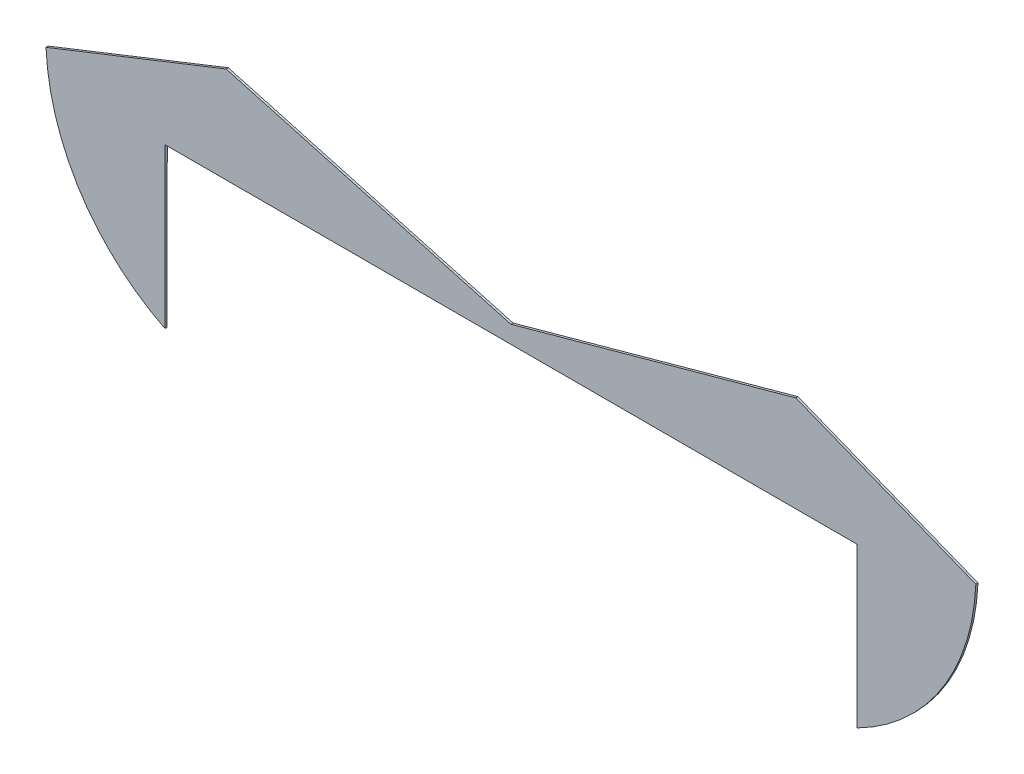
ISO-10303-21;
HEADER;
FILE_DESCRIPTION(('STEP AP214'),'2;1');
FILE_NAME('part.step','',(''),(''),'','','');
FILE_SCHEMA(('AUTOMOTIVE_DESIGN { 1 0 10303 214 1 1 1 1 }'));
ENDSEC;
DATA;
#1=APPLICATION_CONTEXT('core data for automotive mechanical design processes');
#2=APPLICATION_PROTOCOL_DEFINITION('international standard','automotive_design',2000,#1);
#3=PRODUCT_CONTEXT('',#1,'mechanical');
#4=PRODUCT('Part','Part','',(#3));
#5=PRODUCT_RELATED_PRODUCT_CATEGORY('part','',(#4));
#6=PRODUCT_DEFINITION_FORMATION('','',#4);
#7=PRODUCT_DEFINITION_CONTEXT('part definition',#1,'design');
#8=PRODUCT_DEFINITION('design','',#6,#7);
#9=PRODUCT_DEFINITION_SHAPE('','',#8);
#10=(LENGTH_UNIT() NAMED_UNIT(*) SI_UNIT(.MILLI.,.METRE.));
#11=(NAMED_UNIT(*) PLANE_ANGLE_UNIT() SI_UNIT($,.RADIAN.));
#12=(NAMED_UNIT(*) SI_UNIT($,.STERADIAN.) SOLID_ANGLE_UNIT());
#13=UNCERTAINTY_MEASURE_WITH_UNIT(LENGTH_MEASURE(1.E-05),#10,'distance_accuracy_value','');
#14=(GEOMETRIC_REPRESENTATION_CONTEXT(3) GLOBAL_UNCERTAINTY_ASSIGNED_CONTEXT((#13)) GLOBAL_UNIT_ASSIGNED_CONTEXT((#10,
#11,#12)) REPRESENTATION_CONTEXT('',''));
#15=CARTESIAN_POINT('',(0.,0.,0.));
#16=DIRECTION('',(0.,0.,1.));
#17=DIRECTION('',(1.,0.,0.));
#18=AXIS2_PLACEMENT_3D('',#15,#16,#17);
#19=CARTESIAN_POINT('',(23.1397358936744,18.5168922845504,0.1));
#20=DIRECTION('',(0.,0.,-1.));
#21=DIRECTION('',(-1.,0.,0.));
#22=AXIS2_PLACEMENT_3D('',#19,#20,#21);
#23=CYLINDRICAL_SURFACE('',#22,10.1092077518607);
#24=CARTESIAN_POINT('',(23.1397358936744,18.5168922845504,0.));
#25=DIRECTION('',(0.,0.,1.));
#26=DIRECTION('',(1.,0.,0.));
#27=AXIS2_PLACEMENT_3D('',#24,#25,#26);
#28=CIRCLE('',#27,10.1092077518607);
#29=CARTESIAN_POINT('',(13.0400932848332,18.0772327071957,0.));
#30=VERTEX_POINT('',#29);
#31=CARTESIAN_POINT('',(14.4941914447268,13.2775562052793,0.));
#32=VERTEX_POINT('',#31);
#33=EDGE_CURVE('E141',#30,#32,#28,.T.);
#34=ORIENTED_EDGE('',*,*,#33,.T.);
#35=DIRECTION('',(0.,0.,-1.));
#36=VECTOR('',#35,1.);
#37=CARTESIAN_POINT('',(14.4941914447268,13.2775562052793,0.1));
#38=LINE('',#37,#36);
#39=CARTESIAN_POINT('',(14.4941914447268,13.2775562052793,0.1));
#40=VERTEX_POINT('',#39);
#41=EDGE_CURVE('E11',#40,#32,#38,.T.);
#42=ORIENTED_EDGE('',*,*,#41,.F.);
#43=CARTESIAN_POINT('',(23.1397358936744,18.5168922845504,0.1));
#44=DIRECTION('',(0.,0.,1.));
#45=DIRECTION('',(1.,0.,0.));
#46=AXIS2_PLACEMENT_3D('',#43,#44,#45);
#47=CIRCLE('',#46,10.1092077518607);
#48=CARTESIAN_POINT('',(13.0400932848332,18.0772327071957,0.1));
#49=VERTEX_POINT('',#48);
#50=EDGE_CURVE('E161',#49,#40,#47,.T.);
#51=ORIENTED_EDGE('',*,*,#50,.F.);
#52=DIRECTION('',(0.,0.,-1.));
#53=VECTOR('',#52,1.);
#54=CARTESIAN_POINT('',(13.0400932848332,18.0772327071957,0.1));
#55=LINE('',#54,#53);
#56=EDGE_CURVE('E137',#49,#30,#55,.T.);
#57=ORIENTED_EDGE('',*,*,#56,.T.);
#58=EDGE_LOOP('',(#34,#42,#51,#57));
#59=FACE_BOUND('',#58,.T.);
#60=ADVANCED_FACE('F33',(#59),#23,.T.);
#61=CARTESIAN_POINT('',(22.9791031053819,18.4661762448987,0.1));
#62=DIRECTION('',(0.,0.,-1.));
#63=DIRECTION('',(-1.,0.,0.));
#64=AXIS2_PLACEMENT_3D('',#61,#62,#63);
#65=CYLINDRICAL_SURFACE('',#64,9.94562737109439);
#66=CARTESIAN_POINT('',(22.9791031053819,18.4661762448987,0.));
#67=DIRECTION('',(0.,0.,1.));
#68=DIRECTION('',(1.,0.,0.));
#69=AXIS2_PLACEMENT_3D('',#66,#67,#68);
#70=CIRCLE('',#69,9.94562737109439);
#71=CARTESIAN_POINT('',(18.5466400125416,9.56287490577339,0.));
#72=VERTEX_POINT('',#71);
#73=EDGE_CURVE('E144',#32,#72,#70,.T.);
#74=ORIENTED_EDGE('',*,*,#73,.T.);
#75=DIRECTION('',(0.,0.,-1.));
#76=VECTOR('',#75,1.);
#77=CARTESIAN_POINT('',(18.5466400125416,9.56287490577339,0.1));
#78=LINE('',#77,#76);
#79=CARTESIAN_POINT('',(18.5466400125416,9.56287490577339,0.1));
#80=VERTEX_POINT('',#79);
#81=EDGE_CURVE('E41',#80,#72,#78,.T.);
#82=ORIENTED_EDGE('',*,*,#81,.F.);
#83=CARTESIAN_POINT('',(22.9791031053819,18.4661762448987,0.1));
#84=DIRECTION('',(0.,0.,1.));
#85=DIRECTION('',(1.,0.,0.));
#86=AXIS2_PLACEMENT_3D('',#83,#84,#85);
#87=CIRCLE('',#86,9.94562737109439);
#88=EDGE_CURVE('E98',#40,#80,#87,.T.);
#89=ORIENTED_EDGE('',*,*,#88,.F.);
#90=ORIENTED_EDGE('',*,*,#41,.T.);
#91=EDGE_LOOP('',(#74,#82,#89,#90));
#92=FACE_BOUND('',#91,.T.);
#93=ADVANCED_FACE('F208',(#92),#65,.T.);
#94=CARTESIAN_POINT('',(18.5466400125416,9.56287490577339,0.1));
#95=DIRECTION('',(-0.999999928074789,0.000379276175397335,0.));
#96=DIRECTION('',(-0.000379276175397335,-0.999999928074789,0.));
#97=AXIS2_PLACEMENT_3D('',#94,#95,#96);
#98=PLANE('',#97);
#99=DIRECTION('',(0.000379276175397335,0.999999928074789,0.));
#100=VECTOR('',#99,1.);
#101=CARTESIAN_POINT('',(18.5466400125416,9.56287490577339,0.));
#102=LINE('',#101,#100);
#103=CARTESIAN_POINT('',(18.5494338989535,16.9292385007342,0.));
#104=VERTEX_POINT('',#103);
#105=EDGE_CURVE('E146',#72,#104,#102,.T.);
#106=ORIENTED_EDGE('',*,*,#105,.T.);
#107=DIRECTION('',(0.,0.,-1.));
#108=VECTOR('',#107,1.);
#109=CARTESIAN_POINT('',(18.5494338989535,16.9292385007342,0.1));
#110=LINE('',#109,#108);
#111=CARTESIAN_POINT('',(18.5494338989535,16.9292385007342,0.1));
#112=VERTEX_POINT('',#111);
#113=EDGE_CURVE('E174',#112,#104,#110,.T.);
#114=ORIENTED_EDGE('',*,*,#113,.F.);
#115=DIRECTION('',(0.000379276175397335,0.999999928074789,0.));
#116=VECTOR('',#115,1.);
#117=CARTESIAN_POINT('',(18.5466400125416,9.56287490577339,0.1));
#118=LINE('',#117,#116);
#119=EDGE_CURVE('E182',#80,#112,#118,.T.);
#120=ORIENTED_EDGE('',*,*,#119,.F.);
#121=ORIENTED_EDGE('',*,*,#81,.T.);
#122=EDGE_LOOP('',(#106,#114,#120,#121));
#123=FACE_BOUND('',#122,.T.);
#124=ADVANCED_FACE('F180',(#123),#98,.F.);
#125=CARTESIAN_POINT('',(35.0494338989535,16.9292385007342,0.1));
#126=DIRECTION('',(0.,1.,0.));
#127=DIRECTION('',(0.,0.,1.));
#128=AXIS2_PLACEMENT_3D('',#125,#126,#127);
#129=PLANE('',#128);
#130=DIRECTION('',(1.,0.,0.));
#131=VECTOR('',#130,1.);
#132=CARTESIAN_POINT('',(35.0494338989535,16.9292385007342,0.));
#133=LINE('',#132,#131);
#134=CARTESIAN_POINT('',(50.5494338989535,16.9292385007342,0.));
#135=VERTEX_POINT('',#134);
#136=EDGE_CURVE('E149',#104,#135,#133,.T.);
#137=ORIENTED_EDGE('',*,*,#136,.T.);
#138=DIRECTION('',(0.,0.,-1.));
#139=VECTOR('',#138,1.);
#140=CARTESIAN_POINT('',(50.5494338989535,16.9292385007342,0.1));
#141=LINE('',#140,#139);
#142=CARTESIAN_POINT('',(50.5494338989535,16.9292385007342,0.1));
#143=VERTEX_POINT('',#142);
#144=EDGE_CURVE('E171',#143,#135,#141,.T.);
#145=ORIENTED_EDGE('',*,*,#144,.F.);
#146=DIRECTION('',(1.,0.,0.));
#147=VECTOR('',#146,1.);
#148=CARTESIAN_POINT('',(18.5494338989535,16.9292385007342,0.1));
#149=LINE('',#148,#147);
#150=EDGE_CURVE('E198',#112,#143,#149,.T.);
#151=ORIENTED_EDGE('',*,*,#150,.F.);
#152=ORIENTED_EDGE('',*,*,#113,.T.);
#153=EDGE_LOOP('',(#137,#145,#151,#152));
#154=FACE_BOUND('',#153,.T.);
#155=ADVANCED_FACE('F189',(#154),#129,.F.);
#156=CARTESIAN_POINT('',(50.5494338989535,16.9292385007342,0.1));
#157=DIRECTION('',(1.,0.,0.));
#158=DIRECTION('',(0.,0.,-1.));
#159=AXIS2_PLACEMENT_3D('',#156,#157,#158);
#160=PLANE('',#159);
#161=DIRECTION('',(0.,-1.,0.));
#162=VECTOR('',#161,1.);
#163=CARTESIAN_POINT('',(50.5494338989535,16.9292385007342,0.));
#164=LINE('',#163,#162);
#165=CARTESIAN_POINT('',(50.5494338989535,9.5643948782772,0.));
#166=VERTEX_POINT('',#165);
#167=EDGE_CURVE('E151',#135,#166,#164,.T.);
#168=ORIENTED_EDGE('',*,*,#167,.T.);
#169=DIRECTION('',(0.,0.,-1.));
#170=VECTOR('',#169,1.);
#171=CARTESIAN_POINT('',(50.5494338989535,9.5643948782772,0.1));
#172=LINE('',#171,#170);
#173=CARTESIAN_POINT('',(50.5494338989535,9.5643948782772,0.1));
#174=VERTEX_POINT('',#173);
#175=EDGE_CURVE('E168',#174,#166,#172,.T.);
#176=ORIENTED_EDGE('',*,*,#175,.F.);
#177=DIRECTION('',(0.,-1.,0.));
#178=VECTOR('',#177,1.);
#179=CARTESIAN_POINT('',(50.5494338989535,16.9292385007342,0.1));
#180=LINE('',#179,#178);
#181=EDGE_CURVE('E195',#143,#174,#180,.T.);
#182=ORIENTED_EDGE('',*,*,#181,.F.);
#183=ORIENTED_EDGE('',*,*,#144,.T.);
#184=EDGE_LOOP('',(#168,#176,#182,#183));
#185=FACE_BOUND('',#184,.T.);
#186=ADVANCED_FACE('F193',(#185),#160,.F.);
#187=CARTESIAN_POINT('',(46.0543849149039,18.5078051065591,0.1));
#188=DIRECTION('',(0.,0.,-1.));
#189=DIRECTION('',(-1.,0.,0.));
#190=AXIS2_PLACEMENT_3D('',#187,#188,#189);
#191=CYLINDRICAL_SURFACE('',#190,10.0094980833378);
#192=CARTESIAN_POINT('',(46.0543849149039,18.5078051065591,0.));
#193=DIRECTION('',(0.,0.,1.));
#194=DIRECTION('',(1.,0.,0.));
#195=AXIS2_PLACEMENT_3D('',#192,#193,#194);
#196=CIRCLE('',#195,10.0094980833378);
#197=CARTESIAN_POINT('',(56.0546489204028,18.0779543177191,0.));
#198=VERTEX_POINT('',#197);
#199=EDGE_CURVE('E154',#166,#198,#196,.T.);
#200=ORIENTED_EDGE('',*,*,#199,.T.);
#201=DIRECTION('',(0.,0.,-1.));
#202=VECTOR('',#201,1.);
#203=CARTESIAN_POINT('',(56.0546489204028,18.0779543177191,0.1));
#204=LINE('',#203,#202);
#205=CARTESIAN_POINT('',(56.0546489204028,18.0779543177191,0.1));
#206=VERTEX_POINT('',#205);
#207=EDGE_CURVE('E165',#206,#198,#204,.T.);
#208=ORIENTED_EDGE('',*,*,#207,.F.);
#209=CARTESIAN_POINT('',(46.0543849149039,18.5078051065591,0.1));
#210=DIRECTION('',(0.,0.,1.));
#211=DIRECTION('',(1.,0.,0.));
#212=AXIS2_PLACEMENT_3D('',#209,#210,#211);
#213=CIRCLE('',#212,10.0094980833378);
#214=EDGE_CURVE('E197',#174,#206,#213,.T.);
#215=ORIENTED_EDGE('',*,*,#214,.F.);
#216=ORIENTED_EDGE('',*,*,#175,.T.);
#217=EDGE_LOOP('',(#200,#208,#215,#216));
#218=FACE_BOUND('',#217,.T.);
#219=ADVANCED_FACE('F220',(#218),#191,.T.);
#220=CARTESIAN_POINT('',(56.0546489204028,18.0779543177191,0.1));
#221=DIRECTION('',(-0.368078186645423,-0.929794842164559,0.));
#222=DIRECTION('',(0.929794842164559,-0.368078186645423,0.));
#223=AXIS2_PLACEMENT_3D('',#220,#221,#222);
#224=PLANE('',#223);
#225=DIRECTION('',(-0.929794842164559,0.368078186645423,0.));
#226=VECTOR('',#225,1.);
#227=CARTESIAN_POINT('',(56.0546489204028,18.0779543177191,0.));
#228=LINE('',#227,#226);
#229=CARTESIAN_POINT('',(47.7250703460577,21.3753872976957,0.));
#230=VERTEX_POINT('',#229);
#231=EDGE_CURVE('E156',#198,#230,#228,.T.);
#232=ORIENTED_EDGE('',*,*,#231,.T.);
#233=DIRECTION('',(0.,0.,-1.));
#234=VECTOR('',#233,1.);
#235=CARTESIAN_POINT('',(47.7250703460577,21.3753872976957,0.1));
#236=LINE('',#235,#234);
#237=CARTESIAN_POINT('',(47.7250703460577,21.3753872976957,0.1));
#238=VERTEX_POINT('',#237);
#239=EDGE_CURVE('E132',#238,#230,#236,.T.);
#240=ORIENTED_EDGE('',*,*,#239,.F.);
#241=DIRECTION('',(-0.929794842164559,0.368078186645423,0.));
#242=VECTOR('',#241,1.);
#243=CARTESIAN_POINT('',(56.0546489204028,18.0779543177191,0.1));
#244=LINE('',#243,#242);
#245=EDGE_CURVE('E123',#206,#238,#244,.T.);
#246=ORIENTED_EDGE('',*,*,#245,.F.);
#247=ORIENTED_EDGE('',*,*,#207,.T.);
#248=EDGE_LOOP('',(#232,#240,#246,#247));
#249=FACE_BOUND('',#248,.T.);
#250=ADVANCED_FACE('F223',(#249),#224,.F.);
#251=CARTESIAN_POINT('',(47.7250703460577,21.3753872976957,0.1));
#252=DIRECTION('',(0.266234322571186,-0.963908338736138,0.));
#253=DIRECTION('',(0.963908338736138,0.266234322571186,0.));
#254=AXIS2_PLACEMENT_3D('',#251,#252,#253);
#255=PLANE('',#254);
#256=DIRECTION('',(-0.963908338736138,-0.266234322571186,0.));
#257=VECTOR('',#256,1.);
#258=CARTESIAN_POINT('',(47.7250703460577,21.3753872976957,0.));
#259=LINE('',#258,#257);
#260=CARTESIAN_POINT('',(34.5491480933338,17.7361587588036,0.));
#261=VERTEX_POINT('',#260);
#262=EDGE_CURVE('E131',#230,#261,#259,.T.);
#263=ORIENTED_EDGE('',*,*,#262,.T.);
#264=DIRECTION('',(0.,0.,-1.));
#265=VECTOR('',#264,1.);
#266=CARTESIAN_POINT('',(34.5491480933338,17.7361587588036,0.1));
#267=LINE('',#266,#265);
#268=CARTESIAN_POINT('',(34.5491480933338,17.7361587588036,0.1));
#269=VERTEX_POINT('',#268);
#270=EDGE_CURVE('E128',#269,#261,#267,.T.);
#271=ORIENTED_EDGE('',*,*,#270,.F.);
#272=DIRECTION('',(-0.963908338736138,-0.266234322571186,0.));
#273=VECTOR('',#272,1.);
#274=CARTESIAN_POINT('',(47.7250703460577,21.3753872976957,0.1));
#275=LINE('',#274,#273);
#276=EDGE_CURVE('E117',#238,#269,#275,.T.);
#277=ORIENTED_EDGE('',*,*,#276,.F.);
#278=ORIENTED_EDGE('',*,*,#239,.T.);
#279=EDGE_LOOP('',(#263,#271,#277,#278));
#280=FACE_BOUND('',#279,.T.);
#281=ADVANCED_FACE('F129',(#280),#255,.F.);
#282=CARTESIAN_POINT('',(21.3734322419111,21.3758302536918,0.1));
#283=DIRECTION('',(-0.266268305901821,-0.96389895179535,0.));
#284=DIRECTION('',(0.96389895179535,-0.266268305901821,0.));
#285=AXIS2_PLACEMENT_3D('',#282,#283,#284);
#286=PLANE('',#285);
#287=DIRECTION('',(-0.96389895179535,0.266268305901821,0.));
#288=VECTOR('',#287,1.);
#289=CARTESIAN_POINT('',(21.3734322419111,21.3758302536918,0.));
#290=LINE('',#289,#288);
#291=CARTESIAN_POINT('',(21.3734322419111,21.3758302536918,0.));
#292=VERTEX_POINT('',#291);
#293=EDGE_CURVE('E84',#261,#292,#290,.T.);
#294=ORIENTED_EDGE('',*,*,#293,.T.);
#295=DIRECTION('',(0.,0.,-1.));
#296=VECTOR('',#295,1.);
#297=CARTESIAN_POINT('',(21.3734322419111,21.3758302536918,0.1));
#298=LINE('',#297,#296);
#299=CARTESIAN_POINT('',(21.3734322419111,21.3758302536918,0.1));
#300=VERTEX_POINT('',#299);
#301=EDGE_CURVE('E133',#300,#292,#298,.T.);
#302=ORIENTED_EDGE('',*,*,#301,.F.);
#303=DIRECTION('',(-0.96389895179535,0.266268305901821,0.));
#304=VECTOR('',#303,1.);
#305=CARTESIAN_POINT('',(21.3734322419111,21.3758302536918,0.1));
#306=LINE('',#305,#304);
#307=EDGE_CURVE('E121',#269,#300,#306,.T.);
#308=ORIENTED_EDGE('',*,*,#307,.F.);
#309=ORIENTED_EDGE('',*,*,#270,.T.);
#310=EDGE_LOOP('',(#294,#302,#308,#309));
#311=FACE_BOUND('',#310,.T.);
#312=ADVANCED_FACE('F135',(#311),#286,.F.);
#313=CARTESIAN_POINT('',(13.0400932848332,18.0772327071957,0.1));
#314=DIRECTION('',(0.36804692779621,-0.929807216007583,0.));
#315=DIRECTION('',(0.929807216007583,0.36804692779621,0.));
#316=AXIS2_PLACEMENT_3D('',#313,#314,#315);
#317=PLANE('',#316);
#318=DIRECTION('',(-0.929807216007583,-0.36804692779621,0.));
#319=VECTOR('',#318,1.);
#320=CARTESIAN_POINT('',(13.0400932848332,18.0772327071957,0.));
#321=LINE('',#320,#319);
#322=EDGE_CURVE('E90',#292,#30,#321,.T.);
#323=ORIENTED_EDGE('',*,*,#322,.T.);
#324=ORIENTED_EDGE('',*,*,#56,.F.);
#325=DIRECTION('',(-0.929807216007583,-0.36804692779621,0.));
#326=VECTOR('',#325,1.);
#327=CARTESIAN_POINT('',(13.0400932848332,18.0772327071957,0.1));
#328=LINE('',#327,#326);
#329=EDGE_CURVE('E49',#300,#49,#328,.T.);
#330=ORIENTED_EDGE('',*,*,#329,.F.);
#331=ORIENTED_EDGE('',*,*,#301,.T.);
#332=EDGE_LOOP('',(#323,#324,#330,#331));
#333=FACE_BOUND('',#332,.T.);
#334=ADVANCED_FACE('F232',(#333),#317,.F.);
#335=CARTESIAN_POINT('',(23.1397358936744,18.5168922845504,0.1));
#336=DIRECTION('',(0.,0.,1.));
#337=DIRECTION('',(1.,0.,0.));
#338=AXIS2_PLACEMENT_3D('',#335,#336,#337);
#339=PLANE('',#338);
#340=ORIENTED_EDGE('',*,*,#50,.T.);
#341=ORIENTED_EDGE('',*,*,#88,.T.);
#342=ORIENTED_EDGE('',*,*,#119,.T.);
#343=ORIENTED_EDGE('',*,*,#150,.T.);
#344=ORIENTED_EDGE('',*,*,#181,.T.);
#345=ORIENTED_EDGE('',*,*,#214,.T.);
#346=ORIENTED_EDGE('',*,*,#245,.T.);
#347=ORIENTED_EDGE('',*,*,#276,.T.);
#348=ORIENTED_EDGE('',*,*,#307,.T.);
#349=ORIENTED_EDGE('',*,*,#329,.T.);
#350=EDGE_LOOP('',(#340,#341,#342,#343,#344,#345,#346,#347,#348,#349));
#351=FACE_BOUND('',#350,.T.);
#352=ADVANCED_FACE('F119',(#351),#339,.T.);
#353=CARTESIAN_POINT('',(23.1397358936744,18.5168922845504,0.));
#354=DIRECTION('',(0.,0.,1.));
#355=DIRECTION('',(1.,0.,0.));
#356=AXIS2_PLACEMENT_3D('',#353,#354,#355);
#357=PLANE('',#356);
#358=ORIENTED_EDGE('',*,*,#33,.F.);
#359=ORIENTED_EDGE('',*,*,#322,.F.);
#360=ORIENTED_EDGE('',*,*,#293,.F.);
#361=ORIENTED_EDGE('',*,*,#262,.F.);
#362=ORIENTED_EDGE('',*,*,#231,.F.);
#363=ORIENTED_EDGE('',*,*,#199,.F.);
#364=ORIENTED_EDGE('',*,*,#167,.F.);
#365=ORIENTED_EDGE('',*,*,#136,.F.);
#366=ORIENTED_EDGE('',*,*,#105,.F.);
#367=ORIENTED_EDGE('',*,*,#73,.F.);
#368=EDGE_LOOP('',(#358,#359,#360,#361,#362,#363,#364,#365,#366,#367));
#369=FACE_BOUND('',#368,.T.);
#370=ADVANCED_FACE('F185',(#369),#357,.F.);
#371=CLOSED_SHELL('',(#60,#93,#124,#155,#186,#219,#250,#281,#312,#334,#352,#370));
#372=MANIFOLD_SOLID_BREP('B2',#371);
#373=ADVANCED_BREP_SHAPE_REPRESENTATION('',(#18,#372),#14);
#374=SHAPE_DEFINITION_REPRESENTATION(#9,#373);
ENDSEC;
END-ISO-10303-21;
